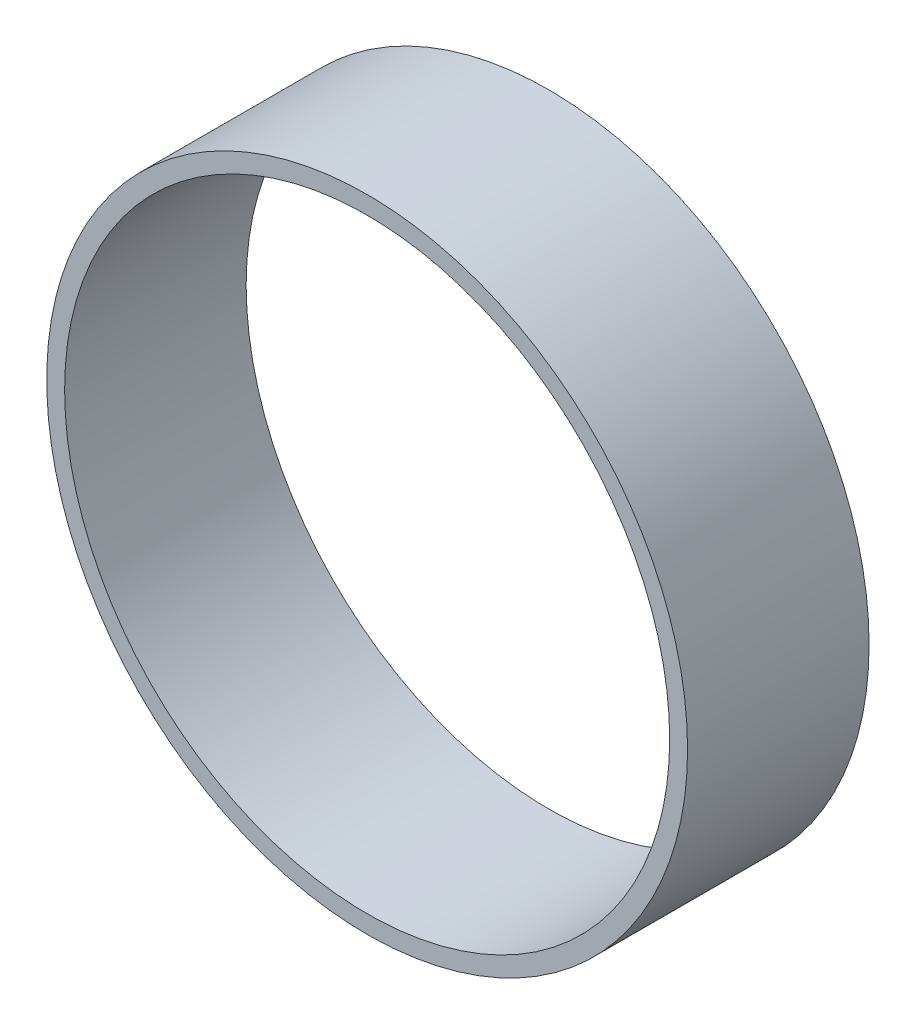
ISO-10303-21;
HEADER;
FILE_DESCRIPTION(('STEP AP214'),'2;1');
FILE_NAME('part.step','',(''),(''),'','','');
FILE_SCHEMA(('AUTOMOTIVE_DESIGN { 1 0 10303 214 1 1 1 1 }'));
ENDSEC;
DATA;
#1=APPLICATION_CONTEXT('core data for automotive mechanical design processes');
#2=APPLICATION_PROTOCOL_DEFINITION('international standard','automotive_design',2000,#1);
#3=PRODUCT_CONTEXT('',#1,'mechanical');
#4=PRODUCT('Part','Part','',(#3));
#5=PRODUCT_RELATED_PRODUCT_CATEGORY('part','',(#4));
#6=PRODUCT_DEFINITION_FORMATION('','',#4);
#7=PRODUCT_DEFINITION_CONTEXT('part definition',#1,'design');
#8=PRODUCT_DEFINITION('design','',#6,#7);
#9=PRODUCT_DEFINITION_SHAPE('','',#8);
#10=(LENGTH_UNIT() NAMED_UNIT(*) SI_UNIT(.MILLI.,.METRE.));
#11=(NAMED_UNIT(*) PLANE_ANGLE_UNIT() SI_UNIT($,.RADIAN.));
#12=(NAMED_UNIT(*) SI_UNIT($,.STERADIAN.) SOLID_ANGLE_UNIT());
#13=UNCERTAINTY_MEASURE_WITH_UNIT(LENGTH_MEASURE(1.E-05),#10,'distance_accuracy_value','');
#14=(GEOMETRIC_REPRESENTATION_CONTEXT(3) GLOBAL_UNCERTAINTY_ASSIGNED_CONTEXT((#13)) GLOBAL_UNIT_ASSIGNED_CONTEXT((#10,
#11,#12)) REPRESENTATION_CONTEXT('',''));
#15=CARTESIAN_POINT('',(0.,0.,0.));
#16=DIRECTION('',(0.,0.,1.));
#17=DIRECTION('',(1.,0.,0.));
#18=AXIS2_PLACEMENT_3D('',#15,#16,#17);
#19=CARTESIAN_POINT('',(0.,0.,22.86));
#20=DIRECTION('',(0.,0.,1.));
#21=DIRECTION('',(1.,0.,0.));
#22=AXIS2_PLACEMENT_3D('',#19,#20,#21);
#23=PLANE('',#22);
#24=CARTESIAN_POINT('',(0.,0.,22.86));
#25=DIRECTION('',(0.,0.,1.));
#26=DIRECTION('',(1.,0.,0.));
#27=AXIS2_PLACEMENT_3D('',#24,#25,#26);
#28=CIRCLE('',#27,40.3541309945447);
#29=CARTESIAN_POINT('',(40.3541309945447,0.,22.86));
#30=VERTEX_POINT('',#29);
#31=EDGE_CURVE('E10',#30,#30,#28,.T.);
#32=ORIENTED_EDGE('',*,*,#31,.T.);
#33=EDGE_LOOP('',(#32));
#34=FACE_BOUND('',#33,.T.);
#35=CARTESIAN_POINT('',(0.,0.,22.86));
#36=DIRECTION('',(0.,0.,1.));
#37=DIRECTION('',(1.,0.,0.));
#38=AXIS2_PLACEMENT_3D('',#35,#36,#37);
#39=CIRCLE('',#38,38.1);
#40=CARTESIAN_POINT('',(38.1,0.,22.86));
#41=VERTEX_POINT('',#40);
#42=EDGE_CURVE('E50',#41,#41,#39,.T.);
#43=ORIENTED_EDGE('',*,*,#42,.F.);
#44=EDGE_LOOP('',(#43));
#45=FACE_BOUND('',#44,.T.);
#46=ADVANCED_FACE('F37',(#34,#45),#23,.T.);
#47=CARTESIAN_POINT('',(0.,0.,0.));
#48=DIRECTION('',(0.,0.,1.));
#49=DIRECTION('',(1.,0.,0.));
#50=AXIS2_PLACEMENT_3D('',#47,#48,#49);
#51=PLANE('',#50);
#52=CARTESIAN_POINT('',(0.,0.,0.));
#53=DIRECTION('',(0.,0.,1.));
#54=DIRECTION('',(1.,0.,0.));
#55=AXIS2_PLACEMENT_3D('',#52,#53,#54);
#56=CIRCLE('',#55,40.3541309945447);
#57=CARTESIAN_POINT('',(40.3541309945447,0.,0.));
#58=VERTEX_POINT('',#57);
#59=EDGE_CURVE('E41',#58,#58,#56,.T.);
#60=ORIENTED_EDGE('',*,*,#59,.F.);
#61=EDGE_LOOP('',(#60));
#62=FACE_BOUND('',#61,.T.);
#63=CARTESIAN_POINT('',(0.,0.,0.));
#64=DIRECTION('',(0.,0.,1.));
#65=DIRECTION('',(1.,0.,0.));
#66=AXIS2_PLACEMENT_3D('',#63,#64,#65);
#67=CIRCLE('',#66,38.1);
#68=CARTESIAN_POINT('',(38.1,0.,0.));
#69=VERTEX_POINT('',#68);
#70=EDGE_CURVE('E52',#69,#69,#67,.T.);
#71=ORIENTED_EDGE('',*,*,#70,.T.);
#72=EDGE_LOOP('',(#71));
#73=FACE_BOUND('',#72,.T.);
#74=ADVANCED_FACE('F64',(#62,#73),#51,.F.);
#75=CARTESIAN_POINT('',(0.,0.,22.86));
#76=DIRECTION('',(0.,0.,-1.));
#77=DIRECTION('',(-1.,0.,0.));
#78=AXIS2_PLACEMENT_3D('',#75,#76,#77);
#79=CYLINDRICAL_SURFACE('',#78,40.3541309945447);
#80=ORIENTED_EDGE('',*,*,#31,.F.);
#81=EDGE_LOOP('',(#80));
#82=FACE_BOUND('',#81,.T.);
#83=ORIENTED_EDGE('',*,*,#59,.T.);
#84=EDGE_LOOP('',(#83));
#85=FACE_BOUND('',#84,.T.);
#86=ADVANCED_FACE('F39',(#82,#85),#79,.T.);
#87=CARTESIAN_POINT('',(0.,0.,22.86));
#88=DIRECTION('',(0.,0.,-1.));
#89=DIRECTION('',(-1.,0.,0.));
#90=AXIS2_PLACEMENT_3D('',#87,#88,#89);
#91=CYLINDRICAL_SURFACE('',#90,38.1);
#92=ORIENTED_EDGE('',*,*,#42,.T.);
#93=EDGE_LOOP('',(#92));
#94=FACE_BOUND('',#93,.T.);
#95=ORIENTED_EDGE('',*,*,#70,.F.);
#96=EDGE_LOOP('',(#95));
#97=FACE_BOUND('',#96,.T.);
#98=ADVANCED_FACE('F60',(#94,#97),#91,.F.);
#99=CLOSED_SHELL('',(#46,#74,#86,#98));
#100=MANIFOLD_SOLID_BREP('B2',#99);
#101=ADVANCED_BREP_SHAPE_REPRESENTATION('',(#18,#100),#14);
#102=SHAPE_DEFINITION_REPRESENTATION(#9,#101);
ENDSEC;
END-ISO-10303-21;
